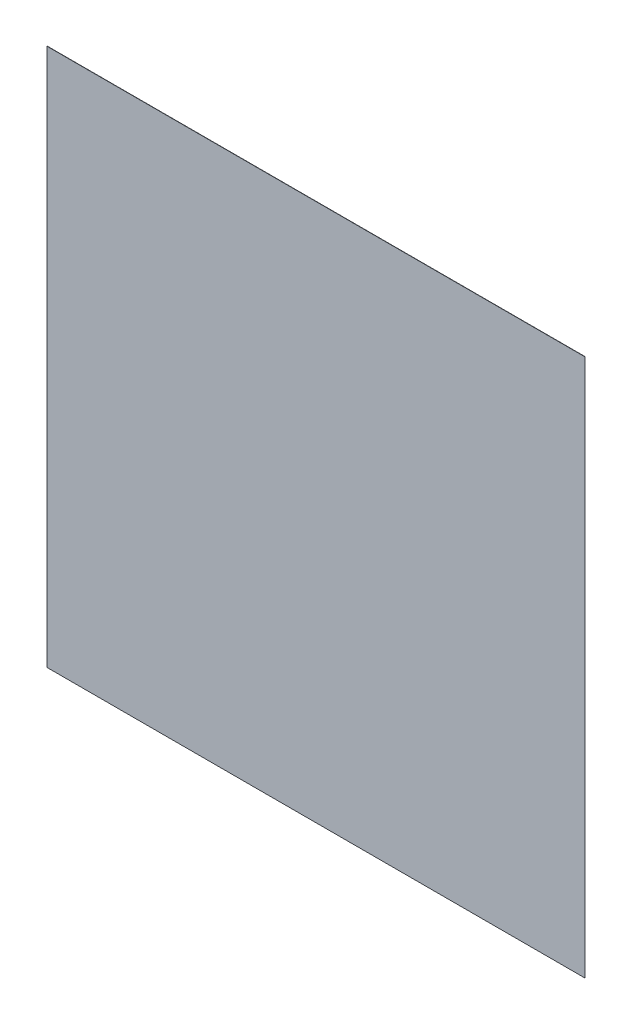
ISO-10303-21;
HEADER;
FILE_DESCRIPTION(('STEP AP214'),'2;1');
FILE_NAME('part.step','',(''),(''),'','','');
FILE_SCHEMA(('AUTOMOTIVE_DESIGN { 1 0 10303 214 1 1 1 1 }'));
ENDSEC;
DATA;
#1=APPLICATION_CONTEXT('core data for automotive mechanical design processes');
#2=APPLICATION_PROTOCOL_DEFINITION('international standard','automotive_design',2000,#1);
#3=PRODUCT_CONTEXT('',#1,'mechanical');
#4=PRODUCT('Part','Part','',(#3));
#5=PRODUCT_RELATED_PRODUCT_CATEGORY('part','',(#4));
#6=PRODUCT_DEFINITION_FORMATION('','',#4);
#7=PRODUCT_DEFINITION_CONTEXT('part definition',#1,'design');
#8=PRODUCT_DEFINITION('design','',#6,#7);
#9=PRODUCT_DEFINITION_SHAPE('','',#8);
#10=(LENGTH_UNIT() NAMED_UNIT(*) SI_UNIT(.MILLI.,.METRE.));
#11=(NAMED_UNIT(*) PLANE_ANGLE_UNIT() SI_UNIT($,.RADIAN.));
#12=(NAMED_UNIT(*) SI_UNIT($,.STERADIAN.) SOLID_ANGLE_UNIT());
#13=UNCERTAINTY_MEASURE_WITH_UNIT(LENGTH_MEASURE(1.E-05),#10,'distance_accuracy_value','');
#14=(GEOMETRIC_REPRESENTATION_CONTEXT(3) GLOBAL_UNCERTAINTY_ASSIGNED_CONTEXT((#13)) GLOBAL_UNIT_ASSIGNED_CONTEXT((#10,
#11,#12)) REPRESENTATION_CONTEXT('',''));
#15=CARTESIAN_POINT('',(0.,0.,0.));
#16=DIRECTION('',(0.,0.,1.));
#17=DIRECTION('',(1.,0.,0.));
#18=AXIS2_PLACEMENT_3D('',#15,#16,#17);
#19=CARTESIAN_POINT('',(-101.6,101.6,-0.1));
#20=DIRECTION('',(-1.,0.,0.));
#21=DIRECTION('',(0.,-1.,0.));
#22=AXIS2_PLACEMENT_3D('',#19,#20,#21);
#23=PLANE('',#22);
#24=DIRECTION('',(0.,-1.,0.));
#25=VECTOR('',#24,1.);
#26=CARTESIAN_POINT('',(-101.6,101.6,0.));
#27=LINE('',#26,#25);
#28=CARTESIAN_POINT('',(-101.6,101.6,0.));
#29=VERTEX_POINT('',#28);
#30=CARTESIAN_POINT('',(-101.6,-101.6,0.));
#31=VERTEX_POINT('',#30);
#32=EDGE_CURVE('E95',#29,#31,#27,.T.);
#33=ORIENTED_EDGE('',*,*,#32,.F.);
#34=DIRECTION('',(0.,0.,1.));
#35=VECTOR('',#34,1.);
#36=CARTESIAN_POINT('',(-101.6,101.6,-0.1));
#37=LINE('',#36,#35);
#38=CARTESIAN_POINT('',(-101.6,101.6,-0.1));
#39=VERTEX_POINT('',#38);
#40=EDGE_CURVE('E11',#39,#29,#37,.T.);
#41=ORIENTED_EDGE('',*,*,#40,.F.);
#42=DIRECTION('',(0.,-1.,0.));
#43=VECTOR('',#42,1.);
#44=CARTESIAN_POINT('',(-101.6,101.6,-0.1));
#45=LINE('',#44,#43);
#46=CARTESIAN_POINT('',(-101.6,-101.6,-0.1));
#47=VERTEX_POINT('',#46);
#48=EDGE_CURVE('E89',#39,#47,#45,.T.);
#49=ORIENTED_EDGE('',*,*,#48,.T.);
#50=DIRECTION('',(0.,0.,1.));
#51=VECTOR('',#50,1.);
#52=CARTESIAN_POINT('',(-101.6,-101.6,-0.1));
#53=LINE('',#52,#51);
#54=EDGE_CURVE('E34',#47,#31,#53,.T.);
#55=ORIENTED_EDGE('',*,*,#54,.T.);
#56=EDGE_LOOP('',(#33,#41,#49,#55));
#57=FACE_BOUND('',#56,.T.);
#58=ADVANCED_FACE('F31',(#57),#23,.T.);
#59=CARTESIAN_POINT('',(-101.6,101.6,-0.1));
#60=DIRECTION('',(0.,1.,0.));
#61=DIRECTION('',(0.,0.,1.));
#62=AXIS2_PLACEMENT_3D('',#59,#60,#61);
#63=PLANE('',#62);
#64=DIRECTION('',(-1.,0.,0.));
#65=VECTOR('',#64,1.);
#66=CARTESIAN_POINT('',(-101.6,101.6,0.));
#67=LINE('',#66,#65);
#68=CARTESIAN_POINT('',(101.6,101.6,0.));
#69=VERTEX_POINT('',#68);
#70=EDGE_CURVE('E91',#69,#29,#67,.T.);
#71=ORIENTED_EDGE('',*,*,#70,.F.);
#72=DIRECTION('',(0.,0.,1.));
#73=VECTOR('',#72,1.);
#74=CARTESIAN_POINT('',(101.6,101.6,-0.1));
#75=LINE('',#74,#73);
#76=CARTESIAN_POINT('',(101.6,101.6,-0.1));
#77=VERTEX_POINT('',#76);
#78=EDGE_CURVE('E40',#77,#69,#75,.T.);
#79=ORIENTED_EDGE('',*,*,#78,.F.);
#80=DIRECTION('',(-1.,0.,0.));
#81=VECTOR('',#80,1.);
#82=CARTESIAN_POINT('',(-101.6,101.6,-0.1));
#83=LINE('',#82,#81);
#84=EDGE_CURVE('E86',#77,#39,#83,.T.);
#85=ORIENTED_EDGE('',*,*,#84,.T.);
#86=ORIENTED_EDGE('',*,*,#40,.T.);
#87=EDGE_LOOP('',(#71,#79,#85,#86));
#88=FACE_BOUND('',#87,.T.);
#89=ADVANCED_FACE('F105',(#88),#63,.T.);
#90=CARTESIAN_POINT('',(101.6,101.6,-0.1));
#91=DIRECTION('',(1.,0.,0.));
#92=DIRECTION('',(0.,1.,0.));
#93=AXIS2_PLACEMENT_3D('',#90,#91,#92);
#94=PLANE('',#93);
#95=DIRECTION('',(0.,1.,0.));
#96=VECTOR('',#95,1.);
#97=CARTESIAN_POINT('',(101.6,101.6,0.));
#98=LINE('',#97,#96);
#99=CARTESIAN_POINT('',(101.6,-101.6,0.));
#100=VERTEX_POINT('',#99);
#101=EDGE_CURVE('E81',#100,#69,#98,.T.);
#102=ORIENTED_EDGE('',*,*,#101,.F.);
#103=DIRECTION('',(0.,0.,1.));
#104=VECTOR('',#103,1.);
#105=CARTESIAN_POINT('',(101.6,-101.6,-0.1));
#106=LINE('',#105,#104);
#107=CARTESIAN_POINT('',(101.6,-101.6,-0.1));
#108=VERTEX_POINT('',#107);
#109=EDGE_CURVE('E76',#108,#100,#106,.T.);
#110=ORIENTED_EDGE('',*,*,#109,.F.);
#111=DIRECTION('',(0.,1.,0.));
#112=VECTOR('',#111,1.);
#113=CARTESIAN_POINT('',(101.6,101.6,-0.1));
#114=LINE('',#113,#112);
#115=EDGE_CURVE('E79',#108,#77,#114,.T.);
#116=ORIENTED_EDGE('',*,*,#115,.T.);
#117=ORIENTED_EDGE('',*,*,#78,.T.);
#118=EDGE_LOOP('',(#102,#110,#116,#117));
#119=FACE_BOUND('',#118,.T.);
#120=ADVANCED_FACE('F78',(#119),#94,.T.);
#121=CARTESIAN_POINT('',(-101.6,-101.6,-0.1));
#122=DIRECTION('',(0.,-1.,0.));
#123=DIRECTION('',(0.,0.,-1.));
#124=AXIS2_PLACEMENT_3D('',#121,#122,#123);
#125=PLANE('',#124);
#126=DIRECTION('',(1.,0.,0.));
#127=VECTOR('',#126,1.);
#128=CARTESIAN_POINT('',(-101.6,-101.6,0.));
#129=LINE('',#128,#127);
#130=EDGE_CURVE('E98',#31,#100,#129,.T.);
#131=ORIENTED_EDGE('',*,*,#130,.F.);
#132=ORIENTED_EDGE('',*,*,#54,.F.);
#133=DIRECTION('',(1.,0.,0.));
#134=VECTOR('',#133,1.);
#135=CARTESIAN_POINT('',(-101.6,-101.6,-0.1));
#136=LINE('',#135,#134);
#137=EDGE_CURVE('E85',#47,#108,#136,.T.);
#138=ORIENTED_EDGE('',*,*,#137,.T.);
#139=ORIENTED_EDGE('',*,*,#109,.T.);
#140=EDGE_LOOP('',(#131,#132,#138,#139));
#141=FACE_BOUND('',#140,.T.);
#142=ADVANCED_FACE('F88',(#141),#125,.T.);
#143=CARTESIAN_POINT('',(-101.6,-101.6,-0.1));
#144=DIRECTION('',(0.,0.,1.));
#145=DIRECTION('',(1.,0.,0.));
#146=AXIS2_PLACEMENT_3D('',#143,#144,#145);
#147=PLANE('',#146);
#148=ORIENTED_EDGE('',*,*,#48,.F.);
#149=ORIENTED_EDGE('',*,*,#84,.F.);
#150=ORIENTED_EDGE('',*,*,#115,.F.);
#151=ORIENTED_EDGE('',*,*,#137,.F.);
#152=EDGE_LOOP('',(#148,#149,#150,#151));
#153=FACE_BOUND('',#152,.T.);
#154=ADVANCED_FACE('F84',(#153),#147,.F.);
#155=CARTESIAN_POINT('',(-101.6,-101.6,0.));
#156=DIRECTION('',(0.,0.,1.));
#157=DIRECTION('',(1.,0.,0.));
#158=AXIS2_PLACEMENT_3D('',#155,#156,#157);
#159=PLANE('',#158);
#160=ORIENTED_EDGE('',*,*,#32,.T.);
#161=ORIENTED_EDGE('',*,*,#130,.T.);
#162=ORIENTED_EDGE('',*,*,#101,.T.);
#163=ORIENTED_EDGE('',*,*,#70,.T.);
#164=EDGE_LOOP('',(#160,#161,#162,#163));
#165=FACE_BOUND('',#164,.T.);
#166=ADVANCED_FACE('F104',(#165),#159,.T.);
#167=CLOSED_SHELL('',(#58,#89,#120,#142,#154,#166));
#168=MANIFOLD_SOLID_BREP('B2',#167);
#169=ADVANCED_BREP_SHAPE_REPRESENTATION('',(#18,#168),#14);
#170=SHAPE_DEFINITION_REPRESENTATION(#9,#169);
ENDSEC;
END-ISO-10303-21;
